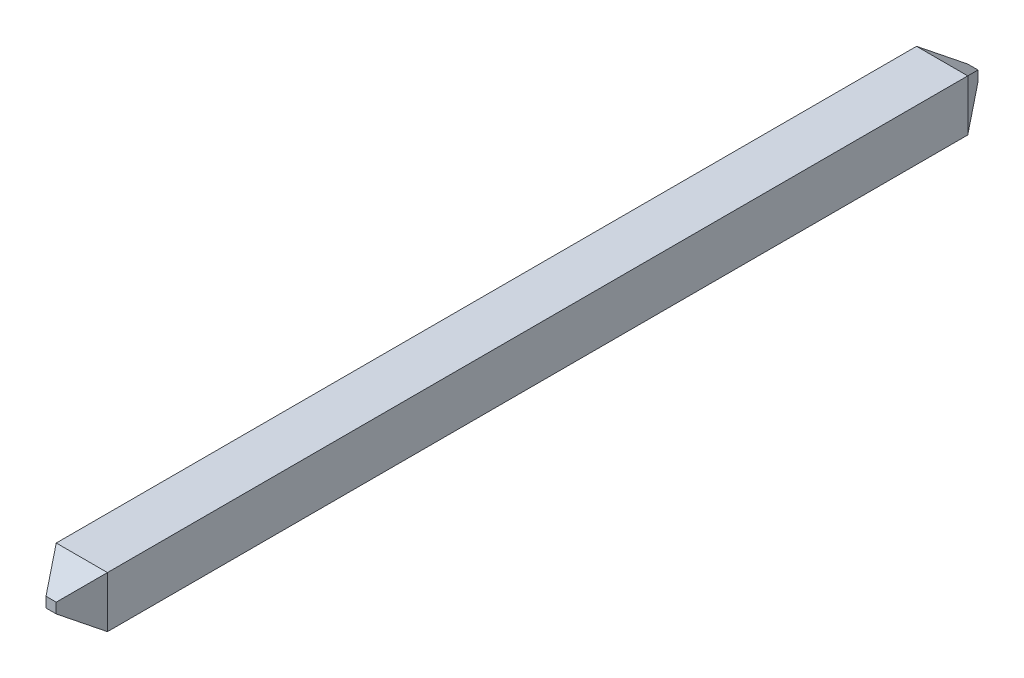
ISO-10303-21;
HEADER;
FILE_DESCRIPTION(('STEP AP214'),'2;1');
FILE_NAME('part.step','',(''),(''),'','','');
FILE_SCHEMA(('AUTOMOTIVE_DESIGN { 1 0 10303 214 1 1 1 1 }'));
ENDSEC;
DATA;
#1=APPLICATION_CONTEXT('core data for automotive mechanical design processes');
#2=APPLICATION_PROTOCOL_DEFINITION('international standard','automotive_design',2000,#1);
#3=PRODUCT_CONTEXT('',#1,'mechanical');
#4=PRODUCT('Part','Part','',(#3));
#5=PRODUCT_RELATED_PRODUCT_CATEGORY('part','',(#4));
#6=PRODUCT_DEFINITION_FORMATION('','',#4);
#7=PRODUCT_DEFINITION_CONTEXT('part definition',#1,'design');
#8=PRODUCT_DEFINITION('design','',#6,#7);
#9=PRODUCT_DEFINITION_SHAPE('','',#8);
#10=(LENGTH_UNIT() NAMED_UNIT(*) SI_UNIT(.MILLI.,.METRE.));
#11=(NAMED_UNIT(*) PLANE_ANGLE_UNIT() SI_UNIT($,.RADIAN.));
#12=(NAMED_UNIT(*) SI_UNIT($,.STERADIAN.) SOLID_ANGLE_UNIT());
#13=UNCERTAINTY_MEASURE_WITH_UNIT(LENGTH_MEASURE(1.E-05),#10,'distance_accuracy_value','');
#14=(GEOMETRIC_REPRESENTATION_CONTEXT(3) GLOBAL_UNCERTAINTY_ASSIGNED_CONTEXT((#13)) GLOBAL_UNIT_ASSIGNED_CONTEXT((#10,
#11,#12)) REPRESENTATION_CONTEXT('',''));
#15=CARTESIAN_POINT('',(0.,0.,0.));
#16=DIRECTION('',(0.,0.,1.));
#17=DIRECTION('',(1.,0.,0.));
#18=AXIS2_PLACEMENT_3D('',#15,#16,#17);
#19=CARTESIAN_POINT('',(0.0635,0.,-6.35));
#20=DIRECTION('',(-0.832050294337843,0.,0.55470019622523));
#21=DIRECTION('',(0.55470019622523,0.,0.832050294337843));
#22=AXIS2_PLACEMENT_3D('',#19,#20,#21);
#23=PLANE('',#22);
#24=DIRECTION('',(0.,1.,0.));
#25=VECTOR('',#24,1.);
#26=CARTESIAN_POINT('',(0.3175,5.3975,-5.969));
#27=LINE('',#26,#25);
#28=CARTESIAN_POINT('',(0.3175,4.7625,-5.969));
#29=VERTEX_POINT('',#28);
#30=CARTESIAN_POINT('',(0.3175,5.3975,-5.969));
#31=VERTEX_POINT('',#30);
#32=EDGE_CURVE('E103',#29,#31,#27,.T.);
#33=ORIENTED_EDGE('',*,*,#32,.F.);
#34=DIRECTION('',(-0.485071250072666,0.485071250072666,-0.727606875108999));
#35=VECTOR('',#34,1.);
#36=CARTESIAN_POINT('',(0.3175,4.7625,-5.969));
#37=LINE('',#36,#35);
#38=CARTESIAN_POINT('',(0.0635,5.0165,-6.35));
#39=VERTEX_POINT('',#38);
#40=EDGE_CURVE('E84',#29,#39,#37,.T.);
#41=ORIENTED_EDGE('',*,*,#40,.T.);
#42=DIRECTION('',(0.,1.,0.));
#43=VECTOR('',#42,1.);
#44=CARTESIAN_POINT('',(0.0635,0.,-6.35));
#45=LINE('',#44,#43);
#46=CARTESIAN_POINT('',(0.0635,5.1435,-6.35));
#47=VERTEX_POINT('',#46);
#48=EDGE_CURVE('E19',#47,#39,#45,.F.);
#49=ORIENTED_EDGE('',*,*,#48,.F.);
#50=DIRECTION('',(0.485071250072666,0.485071250072666,0.727606875108999));
#51=VECTOR('',#50,1.);
#52=CARTESIAN_POINT('',(0.0635,5.1435,-6.35));
#53=LINE('',#52,#51);
#54=EDGE_CURVE('E81',#47,#31,#53,.T.);
#55=ORIENTED_EDGE('',*,*,#54,.T.);
#56=EDGE_LOOP('',(#33,#41,#49,#55));
#57=FACE_BOUND('',#56,.T.);
#58=ADVANCED_FACE('F16',(#57),#23,.F.);
#59=CARTESIAN_POINT('',(0.3175,5.3975,4.699));
#60=DIRECTION('',(0.832050294337844,0.,0.554700196225229));
#61=DIRECTION('',(0.554700196225229,0.,-0.832050294337844));
#62=AXIS2_PLACEMENT_3D('',#59,#60,#61);
#63=PLANE('',#62);
#64=DIRECTION('',(-0.485071250072666,0.485071250072666,0.727606875108999));
#65=VECTOR('',#64,1.);
#66=CARTESIAN_POINT('',(0.3175,4.7625,4.699));
#67=LINE('',#66,#65);
#68=CARTESIAN_POINT('',(0.3175,4.7625,4.699));
#69=VERTEX_POINT('',#68);
#70=CARTESIAN_POINT('',(0.0635,5.0165,5.08));
#71=VERTEX_POINT('',#70);
#72=EDGE_CURVE('E108',#69,#71,#67,.T.);
#73=ORIENTED_EDGE('',*,*,#72,.F.);
#74=DIRECTION('',(0.,1.,0.));
#75=VECTOR('',#74,1.);
#76=CARTESIAN_POINT('',(0.3175,5.3975,4.699));
#77=LINE('',#76,#75);
#78=CARTESIAN_POINT('',(0.3175,5.3975,4.699));
#79=VERTEX_POINT('',#78);
#80=EDGE_CURVE('E105',#79,#69,#77,.F.);
#81=ORIENTED_EDGE('',*,*,#80,.F.);
#82=DIRECTION('',(0.485071250072666,0.485071250072666,-0.727606875108999));
#83=VECTOR('',#82,1.);
#84=CARTESIAN_POINT('',(0.0635,5.1435,5.08));
#85=LINE('',#84,#83);
#86=CARTESIAN_POINT('',(0.0635,5.1435,5.08));
#87=VERTEX_POINT('',#86);
#88=EDGE_CURVE('E115',#87,#79,#85,.T.);
#89=ORIENTED_EDGE('',*,*,#88,.F.);
#90=DIRECTION('',(0.,1.,0.));
#91=VECTOR('',#90,1.);
#92=CARTESIAN_POINT('',(0.0635,0.,5.08));
#93=LINE('',#92,#91);
#94=EDGE_CURVE('E111',#87,#71,#93,.F.);
#95=ORIENTED_EDGE('',*,*,#94,.T.);
#96=EDGE_LOOP('',(#73,#81,#89,#95));
#97=FACE_BOUND('',#96,.T.);
#98=ADVANCED_FACE('F181',(#97),#63,.T.);
#99=CARTESIAN_POINT('',(0.,0.,-6.35));
#100=DIRECTION('',(0.,0.,-1.));
#101=DIRECTION('',(-1.,0.,0.));
#102=AXIS2_PLACEMENT_3D('',#99,#100,#101);
#103=PLANE('',#102);
#104=DIRECTION('',(0.,1.,0.));
#105=VECTOR('',#104,1.);
#106=CARTESIAN_POINT('',(-0.0635,0.,-6.35));
#107=LINE('',#106,#105);
#108=CARTESIAN_POINT('',(-0.0635,5.0165,-6.35));
#109=VERTEX_POINT('',#108);
#110=CARTESIAN_POINT('',(-0.0634999999999999,5.1435,-6.35));
#111=VERTEX_POINT('',#110);
#112=EDGE_CURVE('E90',#109,#111,#107,.T.);
#113=ORIENTED_EDGE('',*,*,#112,.T.);
#114=DIRECTION('',(1.,0.,0.));
#115=VECTOR('',#114,1.);
#116=CARTESIAN_POINT('',(0.,5.1435,-6.35));
#117=LINE('',#116,#115);
#118=EDGE_CURVE('E86',#111,#47,#117,.T.);
#119=ORIENTED_EDGE('',*,*,#118,.T.);
#120=ORIENTED_EDGE('',*,*,#48,.T.);
#121=DIRECTION('',(1.,0.,0.));
#122=VECTOR('',#121,1.);
#123=CARTESIAN_POINT('',(0.,5.0165,-6.35));
#124=LINE('',#123,#122);
#125=EDGE_CURVE('E98',#39,#109,#124,.F.);
#126=ORIENTED_EDGE('',*,*,#125,.T.);
#127=EDGE_LOOP('',(#113,#119,#120,#126));
#128=FACE_BOUND('',#127,.T.);
#129=ADVANCED_FACE('F88',(#128),#103,.T.);
#130=CARTESIAN_POINT('',(0.,5.1435,-6.35));
#131=DIRECTION('',(0.,-0.832050294337843,0.55470019622523));
#132=DIRECTION('',(0.,-0.55470019622523,-0.832050294337843));
#133=AXIS2_PLACEMENT_3D('',#130,#131,#132);
#134=PLANE('',#133);
#135=DIRECTION('',(1.,0.,0.));
#136=VECTOR('',#135,1.);
#137=CARTESIAN_POINT('',(-0.3175,5.3975,-5.969));
#138=LINE('',#137,#136);
#139=CARTESIAN_POINT('',(-0.3175,5.3975,-5.969));
#140=VERTEX_POINT('',#139);
#141=EDGE_CURVE('E96',#31,#140,#138,.F.);
#142=ORIENTED_EDGE('',*,*,#141,.F.);
#143=ORIENTED_EDGE('',*,*,#54,.F.);
#144=ORIENTED_EDGE('',*,*,#118,.F.);
#145=DIRECTION('',(-0.485071250072667,0.485071250072666,0.727606875108998));
#146=VECTOR('',#145,1.);
#147=CARTESIAN_POINT('',(-0.0635,5.1435,-6.35));
#148=LINE('',#147,#146);
#149=EDGE_CURVE('E131',#111,#140,#148,.T.);
#150=ORIENTED_EDGE('',*,*,#149,.T.);
#151=EDGE_LOOP('',(#142,#143,#144,#150));
#152=FACE_BOUND('',#151,.T.);
#153=ADVANCED_FACE('F94',(#152),#134,.F.);
#154=CARTESIAN_POINT('',(0.,5.0165,-6.35));
#155=DIRECTION('',(0.,0.832050294337843,0.55470019622523));
#156=DIRECTION('',(0.,-0.55470019622523,0.832050294337843));
#157=AXIS2_PLACEMENT_3D('',#154,#155,#156);
#158=PLANE('',#157);
#159=DIRECTION('',(1.,0.,0.));
#160=VECTOR('',#159,1.);
#161=CARTESIAN_POINT('',(0.3175,4.7625,-5.969));
#162=LINE('',#161,#160);
#163=CARTESIAN_POINT('',(-0.3175,4.7625,-5.969));
#164=VERTEX_POINT('',#163);
#165=EDGE_CURVE('E133',#164,#29,#162,.T.);
#166=ORIENTED_EDGE('',*,*,#165,.F.);
#167=DIRECTION('',(0.485071250072667,0.485071250072666,-0.727606875108998));
#168=VECTOR('',#167,1.);
#169=CARTESIAN_POINT('',(-0.3175,4.7625,-5.969));
#170=LINE('',#169,#168);
#171=EDGE_CURVE('E127',#164,#109,#170,.T.);
#172=ORIENTED_EDGE('',*,*,#171,.T.);
#173=ORIENTED_EDGE('',*,*,#125,.F.);
#174=ORIENTED_EDGE('',*,*,#40,.F.);
#175=EDGE_LOOP('',(#166,#172,#173,#174));
#176=FACE_BOUND('',#175,.T.);
#177=ADVANCED_FACE('F177',(#176),#158,.F.);
#178=CARTESIAN_POINT('',(0.3175,5.3975,5.08));
#179=DIRECTION('',(1.,0.,0.));
#180=DIRECTION('',(0.,0.,-1.));
#181=AXIS2_PLACEMENT_3D('',#178,#179,#180);
#182=PLANE('',#181);
#183=DIRECTION('',(0.,0.,1.));
#184=VECTOR('',#183,1.);
#185=CARTESIAN_POINT('',(0.3175,5.3975,5.08));
#186=LINE('',#185,#184);
#187=EDGE_CURVE('E121',#79,#31,#186,.F.);
#188=ORIENTED_EDGE('',*,*,#187,.F.);
#189=ORIENTED_EDGE('',*,*,#80,.T.);
#190=DIRECTION('',(0.,0.,-1.));
#191=VECTOR('',#190,1.);
#192=CARTESIAN_POINT('',(0.3175,4.7625,5.08));
#193=LINE('',#192,#191);
#194=EDGE_CURVE('E136',#29,#69,#193,.F.);
#195=ORIENTED_EDGE('',*,*,#194,.F.);
#196=ORIENTED_EDGE('',*,*,#32,.T.);
#197=EDGE_LOOP('',(#188,#189,#195,#196));
#198=FACE_BOUND('',#197,.T.);
#199=ADVANCED_FACE('F179',(#198),#182,.T.);
#200=CARTESIAN_POINT('',(0.3175,4.7625,4.699));
#201=DIRECTION('',(0.,-0.832050294337844,0.554700196225229));
#202=DIRECTION('',(0.,-0.554700196225229,-0.832050294337844));
#203=AXIS2_PLACEMENT_3D('',#200,#201,#202);
#204=PLANE('',#203);
#205=DIRECTION('',(0.485071250072666,0.485071250072666,0.727606875108999));
#206=VECTOR('',#205,1.);
#207=CARTESIAN_POINT('',(-0.3175,4.7625,4.699));
#208=LINE('',#207,#206);
#209=CARTESIAN_POINT('',(-0.3175,4.7625,4.699));
#210=VERTEX_POINT('',#209);
#211=CARTESIAN_POINT('',(-0.0635,5.0165,5.08));
#212=VERTEX_POINT('',#211);
#213=EDGE_CURVE('E34',#210,#212,#208,.T.);
#214=ORIENTED_EDGE('',*,*,#213,.F.);
#215=DIRECTION('',(1.,0.,0.));
#216=VECTOR('',#215,1.);
#217=CARTESIAN_POINT('',(0.3175,4.7625,4.699));
#218=LINE('',#217,#216);
#219=EDGE_CURVE('E139',#69,#210,#218,.F.);
#220=ORIENTED_EDGE('',*,*,#219,.F.);
#221=ORIENTED_EDGE('',*,*,#72,.T.);
#222=DIRECTION('',(-1.,0.,0.));
#223=VECTOR('',#222,1.);
#224=CARTESIAN_POINT('',(0.,5.0165,5.08));
#225=LINE('',#224,#223);
#226=EDGE_CURVE('E113',#71,#212,#225,.T.);
#227=ORIENTED_EDGE('',*,*,#226,.T.);
#228=EDGE_LOOP('',(#214,#220,#221,#227));
#229=FACE_BOUND('',#228,.T.);
#230=ADVANCED_FACE('F184',(#229),#204,.T.);
#231=CARTESIAN_POINT('',(0.,0.,5.08));
#232=DIRECTION('',(0.,0.,-1.));
#233=DIRECTION('',(-1.,0.,0.));
#234=AXIS2_PLACEMENT_3D('',#231,#232,#233);
#235=PLANE('',#234);
#236=DIRECTION('',(0.,1.,0.));
#237=VECTOR('',#236,1.);
#238=CARTESIAN_POINT('',(-0.0635,4.7625,5.08));
#239=LINE('',#238,#237);
#240=CARTESIAN_POINT('',(-0.0635,5.1435,5.08));
#241=VERTEX_POINT('',#240);
#242=EDGE_CURVE('E142',#212,#241,#239,.T.);
#243=ORIENTED_EDGE('',*,*,#242,.F.);
#244=ORIENTED_EDGE('',*,*,#226,.F.);
#245=ORIENTED_EDGE('',*,*,#94,.F.);
#246=DIRECTION('',(1.,0.,0.));
#247=VECTOR('',#246,1.);
#248=CARTESIAN_POINT('',(-0.3175,5.1435,5.08));
#249=LINE('',#248,#247);
#250=EDGE_CURVE('E118',#241,#87,#249,.T.);
#251=ORIENTED_EDGE('',*,*,#250,.F.);
#252=EDGE_LOOP('',(#243,#244,#245,#251));
#253=FACE_BOUND('',#252,.T.);
#254=ADVANCED_FACE('F186',(#253),#235,.F.);
#255=CARTESIAN_POINT('',(-0.3175,5.3975,4.699));
#256=DIRECTION('',(0.,0.832050294337844,0.554700196225229));
#257=DIRECTION('',(0.,-0.554700196225229,0.832050294337844));
#258=AXIS2_PLACEMENT_3D('',#255,#256,#257);
#259=PLANE('',#258);
#260=DIRECTION('',(-0.485071250072666,0.485071250072666,-0.727606875108999));
#261=VECTOR('',#260,1.);
#262=CARTESIAN_POINT('',(-0.0635,5.1435,5.08));
#263=LINE('',#262,#261);
#264=CARTESIAN_POINT('',(-0.3175,5.3975,4.699));
#265=VERTEX_POINT('',#264);
#266=EDGE_CURVE('E145',#241,#265,#263,.T.);
#267=ORIENTED_EDGE('',*,*,#266,.F.);
#268=ORIENTED_EDGE('',*,*,#250,.T.);
#269=ORIENTED_EDGE('',*,*,#88,.T.);
#270=DIRECTION('',(1.,0.,0.));
#271=VECTOR('',#270,1.);
#272=CARTESIAN_POINT('',(-0.3175,5.3975,4.699));
#273=LINE('',#272,#271);
#274=EDGE_CURVE('E124',#265,#79,#273,.T.);
#275=ORIENTED_EDGE('',*,*,#274,.F.);
#276=EDGE_LOOP('',(#267,#268,#269,#275));
#277=FACE_BOUND('',#276,.T.);
#278=ADVANCED_FACE('F168',(#277),#259,.T.);
#279=CARTESIAN_POINT('',(-0.3175,5.3975,5.08));
#280=DIRECTION('',(0.,1.,0.));
#281=DIRECTION('',(0.,0.,1.));
#282=AXIS2_PLACEMENT_3D('',#279,#280,#281);
#283=PLANE('',#282);
#284=DIRECTION('',(0.,0.,1.));
#285=VECTOR('',#284,1.);
#286=CARTESIAN_POINT('',(-0.3175,5.3975,5.08));
#287=LINE('',#286,#285);
#288=EDGE_CURVE('E148',#265,#140,#287,.F.);
#289=ORIENTED_EDGE('',*,*,#288,.F.);
#290=ORIENTED_EDGE('',*,*,#274,.T.);
#291=ORIENTED_EDGE('',*,*,#187,.T.);
#292=ORIENTED_EDGE('',*,*,#141,.T.);
#293=EDGE_LOOP('',(#289,#290,#291,#292));
#294=FACE_BOUND('',#293,.T.);
#295=ADVANCED_FACE('F171',(#294),#283,.T.);
#296=CARTESIAN_POINT('',(-0.0635,0.,-6.35));
#297=DIRECTION('',(0.832050294337843,0.,0.55470019622523));
#298=DIRECTION('',(0.55470019622523,0.,-0.832050294337843));
#299=AXIS2_PLACEMENT_3D('',#296,#297,#298);
#300=PLANE('',#299);
#301=ORIENTED_EDGE('',*,*,#112,.F.);
#302=ORIENTED_EDGE('',*,*,#171,.F.);
#303=DIRECTION('',(0.,1.,0.));
#304=VECTOR('',#303,1.);
#305=CARTESIAN_POINT('',(-0.3175,4.7625,-5.969));
#306=LINE('',#305,#304);
#307=EDGE_CURVE('E151',#140,#164,#306,.F.);
#308=ORIENTED_EDGE('',*,*,#307,.F.);
#309=ORIENTED_EDGE('',*,*,#149,.F.);
#310=EDGE_LOOP('',(#301,#302,#308,#309));
#311=FACE_BOUND('',#310,.T.);
#312=ADVANCED_FACE('F175',(#311),#300,.F.);
#313=CARTESIAN_POINT('',(0.3175,4.7625,5.08));
#314=DIRECTION('',(0.,-1.,0.));
#315=DIRECTION('',(0.,0.,-1.));
#316=AXIS2_PLACEMENT_3D('',#313,#314,#315);
#317=PLANE('',#316);
#318=ORIENTED_EDGE('',*,*,#194,.T.);
#319=ORIENTED_EDGE('',*,*,#219,.T.);
#320=DIRECTION('',(0.,0.,1.));
#321=VECTOR('',#320,1.);
#322=CARTESIAN_POINT('',(-0.3175,4.7625,5.08));
#323=LINE('',#322,#321);
#324=EDGE_CURVE('E25',#164,#210,#323,.T.);
#325=ORIENTED_EDGE('',*,*,#324,.F.);
#326=ORIENTED_EDGE('',*,*,#165,.T.);
#327=EDGE_LOOP('',(#318,#319,#325,#326));
#328=FACE_BOUND('',#327,.T.);
#329=ADVANCED_FACE('F161',(#328),#317,.T.);
#330=CARTESIAN_POINT('',(-0.3175,4.7625,4.699));
#331=DIRECTION('',(-0.832050294337844,0.,0.554700196225229));
#332=DIRECTION('',(0.554700196225229,0.,0.832050294337844));
#333=AXIS2_PLACEMENT_3D('',#330,#331,#332);
#334=PLANE('',#333);
#335=ORIENTED_EDGE('',*,*,#266,.T.);
#336=DIRECTION('',(0.,1.,0.));
#337=VECTOR('',#336,1.);
#338=CARTESIAN_POINT('',(-0.3175,4.7625,4.699));
#339=LINE('',#338,#337);
#340=EDGE_CURVE('E11',#210,#265,#339,.T.);
#341=ORIENTED_EDGE('',*,*,#340,.F.);
#342=ORIENTED_EDGE('',*,*,#213,.T.);
#343=ORIENTED_EDGE('',*,*,#242,.T.);
#344=EDGE_LOOP('',(#335,#341,#342,#343));
#345=FACE_BOUND('',#344,.T.);
#346=ADVANCED_FACE('F164',(#345),#334,.T.);
#347=CARTESIAN_POINT('',(-0.3175,4.7625,5.08));
#348=DIRECTION('',(-1.,0.,0.));
#349=DIRECTION('',(0.,0.,1.));
#350=AXIS2_PLACEMENT_3D('',#347,#348,#349);
#351=PLANE('',#350);
#352=ORIENTED_EDGE('',*,*,#324,.T.);
#353=ORIENTED_EDGE('',*,*,#340,.T.);
#354=ORIENTED_EDGE('',*,*,#288,.T.);
#355=ORIENTED_EDGE('',*,*,#307,.T.);
#356=EDGE_LOOP('',(#352,#353,#354,#355));
#357=FACE_BOUND('',#356,.T.);
#358=ADVANCED_FACE('F157',(#357),#351,.T.);
#359=CLOSED_SHELL('',(#58,#98,#129,#153,#177,#199,#230,#254,#278,#295,#312,#329,#346,#358));
#360=MANIFOLD_SOLID_BREP('B1',#359);
#361=ADVANCED_BREP_SHAPE_REPRESENTATION('',(#18,#360),#14);
#362=SHAPE_DEFINITION_REPRESENTATION(#9,#361);
ENDSEC;
END-ISO-10303-21;
